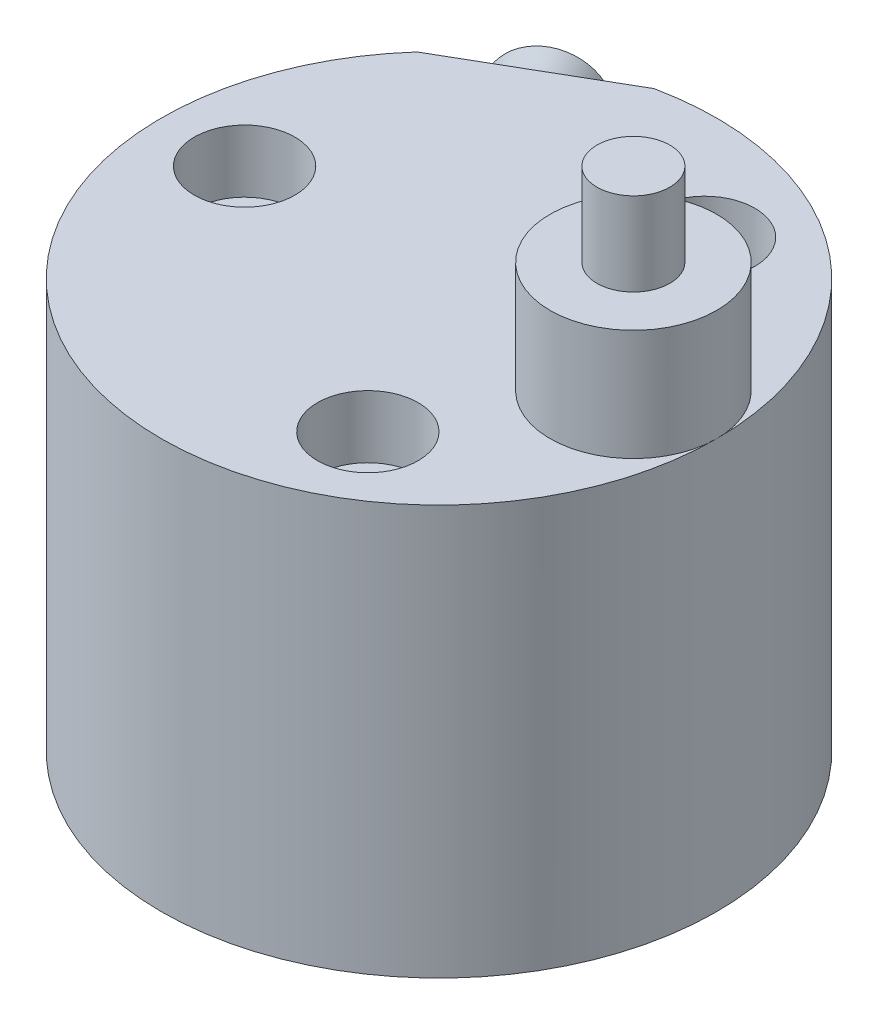
ISO-10303-21;
HEADER;
FILE_DESCRIPTION(('STEP AP214'),'2;1');
FILE_NAME('part.step','',(''),(''),'','','');
FILE_SCHEMA(('AUTOMOTIVE_DESIGN { 1 0 10303 214 1 1 1 1 }'));
ENDSEC;
DATA;
#1=APPLICATION_CONTEXT('core data for automotive mechanical design processes');
#2=APPLICATION_PROTOCOL_DEFINITION('international standard','automotive_design',2000,#1);
#3=PRODUCT_CONTEXT('',#1,'mechanical');
#4=PRODUCT('Part','Part','',(#3));
#5=PRODUCT_RELATED_PRODUCT_CATEGORY('part','',(#4));
#6=PRODUCT_DEFINITION_FORMATION('','',#4);
#7=PRODUCT_DEFINITION_CONTEXT('part definition',#1,'design');
#8=PRODUCT_DEFINITION('design','',#6,#7);
#9=PRODUCT_DEFINITION_SHAPE('','',#8);
#10=(LENGTH_UNIT() NAMED_UNIT(*) SI_UNIT(.MILLI.,.METRE.));
#11=(NAMED_UNIT(*) PLANE_ANGLE_UNIT() SI_UNIT($,.RADIAN.));
#12=(NAMED_UNIT(*) SI_UNIT($,.STERADIAN.) SOLID_ANGLE_UNIT());
#13=UNCERTAINTY_MEASURE_WITH_UNIT(LENGTH_MEASURE(1.E-05),#10,'distance_accuracy_value','');
#14=(GEOMETRIC_REPRESENTATION_CONTEXT(3) GLOBAL_UNCERTAINTY_ASSIGNED_CONTEXT((#13)) GLOBAL_UNIT_ASSIGNED_CONTEXT((#10,
#11,#12)) REPRESENTATION_CONTEXT('',''));
#15=CARTESIAN_POINT('',(0.,0.,0.));
#16=DIRECTION('',(0.,0.,1.));
#17=DIRECTION('',(1.,0.,0.));
#18=AXIS2_PLACEMENT_3D('',#15,#16,#17);
#19=CARTESIAN_POINT('',(-29.816653826392,43.5,-26.6639673454102));
#20=DIRECTION('',(0.5,0.,0.866025403784439));
#21=DIRECTION('',(0.866025403784439,0.,-0.5));
#22=AXIS2_PLACEMENT_3D('',#19,#20,#21);
#23=PLANE('',#22);
#24=DIRECTION('',(0.866025403784439,0.,-0.5));
#25=VECTOR('',#24,1.);
#26=CARTESIAN_POINT('',(-29.816653826392,59.,-26.6639673454102));
#27=LINE('',#26,#25);
#28=CARTESIAN_POINT('',(-29.816653826392,59.,-26.6639673454103));
#29=VERTEX_POINT('',#28);
#30=CARTESIAN_POINT('',(-8.18334617360865,59.,-39.1539633422067));
#31=VERTEX_POINT('',#30);
#32=EDGE_CURVE('E177',#29,#31,#27,.T.);
#33=ORIENTED_EDGE('',*,*,#32,.T.);
#34=DIRECTION('',(0.,1.,0.));
#35=VECTOR('',#34,1.);
#36=CARTESIAN_POINT('',(-8.18334617360865,43.5,-39.1539633422067));
#37=LINE('',#36,#35);
#38=CARTESIAN_POINT('',(-8.18334617360865,43.5,-39.1539633422067));
#39=VERTEX_POINT('',#38);
#40=EDGE_CURVE('E564',#39,#31,#37,.T.);
#41=ORIENTED_EDGE('',*,*,#40,.F.);
#42=DIRECTION('',(0.866025403784439,0.,-0.5));
#43=VECTOR('',#42,1.);
#44=CARTESIAN_POINT('',(-29.816653826392,43.5,-26.6639673454102));
#45=LINE('',#44,#43);
#46=CARTESIAN_POINT('',(-29.816653826392,43.5,-26.6639673454102));
#47=VERTEX_POINT('',#46);
#48=EDGE_CURVE('E571',#47,#39,#45,.T.);
#49=ORIENTED_EDGE('',*,*,#48,.F.);
#50=DIRECTION('',(0.,1.,0.));
#51=VECTOR('',#50,1.);
#52=CARTESIAN_POINT('',(-29.816653826392,43.5,-26.6639673454102));
#53=LINE('',#52,#51);
#54=EDGE_CURVE('E58',#47,#29,#53,.T.);
#55=ORIENTED_EDGE('',*,*,#54,.T.);
#56=EDGE_LOOP('',(#33,#41,#49,#55));
#57=FACE_BOUND('',#56,.T.);
#58=CARTESIAN_POINT('',(-18.9999999999996,51.5000000000003,-32.9089653438089));
#59=DIRECTION('',(0.5,0.,0.866025403784439));
#60=DIRECTION('',(0.866025403784439,0.,-0.5));
#61=AXIS2_PLACEMENT_3D('',#58,#59,#60);
#62=CIRCLE('',#61,7.);
#63=CARTESIAN_POINT('',(-12.9378221735086,51.5000000000003,-36.4089653438089));
#64=VERTEX_POINT('',#63);
#65=EDGE_CURVE('E12',#64,#64,#62,.F.);
#66=ORIENTED_EDGE('',*,*,#65,.F.);
#67=EDGE_LOOP('',(#66));
#68=FACE_BOUND('',#67,.T.);
#69=ADVANCED_FACE('F35',(#57,#68),#23,.F.);
#70=CARTESIAN_POINT('',(-25.7927989909334,51.5000000000004,-44.6744383217089));
#71=DIRECTION('',(-0.499999999999994,0.,-0.866025403784442));
#72=DIRECTION('',(-0.866025403784442,0.,0.499999999999995));
#73=AXIS2_PLACEMENT_3D('',#70,#71,#72);
#74=CYLINDRICAL_SURFACE('',#73,4.283);
#75=CARTESIAN_POINT('',(-13.9999999999998,47.3353764876044,-26.2487113059644));
#76=CARTESIAN_POINT('',(-13.8846803501762,47.3593623253568,-26.248703375027));
#77=CARTESIAN_POINT('',(-13.7697517761624,47.3858831845604,-26.2387089174552));
#78=CARTESIAN_POINT('',(-13.5435655926728,47.4411635474235,-26.1993313219503));
#79=CARTESIAN_POINT('',(-13.4323200942791,47.4699295587522,-26.1698898250953));
#80=CARTESIAN_POINT('',(-13.2163402167066,47.5264870806709,-26.0923543062892));
#81=CARTESIAN_POINT('',(-13.1116005101973,47.5542793802414,-26.0442757854433));
#82=CARTESIAN_POINT('',(-12.911210223568,47.6055822466804,-25.9303184689779));
#83=CARTESIAN_POINT('',(-12.8155509745316,47.6290969173732,-25.8644568862257));
#84=CARTESIAN_POINT('',(-12.6380956024121,47.6681932309555,-25.7177819363558));
#85=CARTESIAN_POINT('',(-12.5560447879495,47.6839351699755,-25.6373220342316));
#86=CARTESIAN_POINT('',(-12.4064914882523,47.7057478559666,-25.4627557956808));
#87=CARTESIAN_POINT('',(-12.338975367804,47.711827701574,-25.3686623889445));
#88=CARTESIAN_POINT('',(-12.227579503488,47.7132218204603,-25.1809802000658));
#89=CARTESIAN_POINT('',(-12.1819311265704,47.709631432406,-25.0884419293331));
#90=CARTESIAN_POINT('',(-12.1055562513608,47.6944806814061,-24.8980240100651));
#91=CARTESIAN_POINT('',(-12.0748317676831,47.6829192429374,-24.8001436423693));
#92=CARTESIAN_POINT('',(-12.0291471577467,47.6535549602009,-24.6033815888311));
#93=CARTESIAN_POINT('',(-12.0139485642091,47.635852304558,-24.5045393493094));
#94=CARTESIAN_POINT('',(-11.99837038372,47.5961198121907,-24.3065707392702));
#95=CARTESIAN_POINT('',(-11.997996060694,47.5740884411807,-24.2074442803246));
#96=CARTESIAN_POINT('',(-12.0124647762102,47.5254305660545,-24.0007068836194));
#97=CARTESIAN_POINT('',(-12.0288618778782,47.4985645863109,-23.8932603057773));
#98=CARTESIAN_POINT('',(-12.0787981517982,47.4448593754886,-23.6823762337472));
#99=CARTESIAN_POINT('',(-12.1123463111914,47.4180201658325,-23.5789408720352));
#100=CARTESIAN_POINT('',(-12.1988442446768,47.3652724139167,-23.3716348242785));
#101=CARTESIAN_POINT('',(-12.2529307727742,47.3395429202521,-23.2681880785014));
#102=CARTESIAN_POINT('',(-12.3790204887181,47.2939474011823,-23.0714005007499));
#103=CARTESIAN_POINT('',(-12.4510149863006,47.2740785419588,-22.9780547984439));
#104=CARTESIAN_POINT('',(-12.6067782178338,47.2434133551712,-22.8094857039865));
#105=CARTESIAN_POINT('',(-12.6896882850883,47.2321804897941,-22.7335506416689));
#106=CARTESIAN_POINT('',(-12.8675212329224,47.2183426526875,-22.5964164170215));
#107=CARTESIAN_POINT('',(-12.9624371086461,47.2157326737761,-22.5352087218822));
#108=CARTESIAN_POINT('',(-13.1529826481814,47.2192801777482,-22.4339794932127));
#109=CARTESIAN_POINT('',(-13.2479315195338,47.2247444996971,-22.3926433014052));
#110=CARTESIAN_POINT('',(-13.4424603393248,47.2426474611921,-22.3252387938854));
#111=CARTESIAN_POINT('',(-13.5420404745002,47.2550863821845,-22.2991710943898));
#112=CARTESIAN_POINT('',(-13.7436243576298,47.2858374414896,-22.2625526456059));
#113=CARTESIAN_POINT('',(-13.8456378758102,47.3041792091863,-22.2520817094441));
#114=CARTESIAN_POINT('',(-14.0492169158717,47.3450761487807,-22.2467230798684));
#115=CARTESIAN_POINT('',(-14.1507822797518,47.367632701379,-22.2518405013982));
#116=CARTESIAN_POINT('',(-14.3596886867012,47.4170019567712,-22.2782797113492));
#117=CARTESIAN_POINT('',(-14.4668193790618,47.4440120461325,-22.3008973027089));
#118=CARTESIAN_POINT('',(-14.6760150181686,47.4981069225508,-22.3632591362429));
#119=CARTESIAN_POINT('',(-14.7780766909674,47.5251917462581,-22.4030142907386));
#120=CARTESIAN_POINT('',(-14.9807409236475,47.5781317547646,-22.5018324697839));
#121=CARTESIAN_POINT('',(-15.080904711655,47.6038209585609,-22.5618934589876));
#122=CARTESIAN_POINT('',(-15.2701487088774,47.6486870004943,-22.6993975346607));
#123=CARTESIAN_POINT('',(-15.359237391621,47.6678688370692,-22.7768272036071));
#124=CARTESIAN_POINT('',(-15.5178705128638,47.695808953011,-22.9416913532032));
#125=CARTESIAN_POINT('',(-15.5882998715531,47.7051547893636,-23.0281708261566));
#126=CARTESIAN_POINT('',(-15.7139299271114,47.7140395730862,-23.2119794533333));
#127=CARTESIAN_POINT('',(-15.7691408827037,47.7135851432688,-23.3093012363108));
#128=CARTESIAN_POINT('',(-15.857891641831,47.7034899679475,-23.5014835911476));
#129=CARTESIAN_POINT('',(-15.8930124308677,47.6947431871621,-23.5956696472182));
#130=CARTESIAN_POINT('',(-15.9486341852211,47.6704767509161,-23.78741402187));
#131=CARTESIAN_POINT('',(-15.9691312466628,47.6549552887025,-23.8849732336494));
#132=CARTESIAN_POINT('',(-15.9958492360078,47.6183198159408,-24.0843011118719));
#133=CARTESIAN_POINT('',(-16.0015829868995,47.5970399863704,-24.1861033256664));
#134=CARTESIAN_POINT('',(-15.9976682465783,47.5513744625739,-24.3887116668475));
#135=CARTESIAN_POINT('',(-15.9880126448595,47.5269873374416,-24.4895173121227));
#136=CARTESIAN_POINT('',(-15.9518236669629,47.4746549568613,-24.6991425951561));
#137=CARTESIAN_POINT('',(-15.9235717190827,47.4466108531735,-24.8076441024381));
#138=CARTESIAN_POINT('',(-15.8491627628709,47.3923781417469,-25.0188663658474));
#139=CARTESIAN_POINT('',(-15.8030000722642,47.3661901259829,-25.1215852755617));
#140=CARTESIAN_POINT('',(-15.6919934922397,47.3177131732278,-25.3213524092135));
#141=CARTESIAN_POINT('',(-15.6266735385304,47.2955503544806,-25.4181689384037));
#142=CARTESIAN_POINT('',(-15.4793264212072,47.2585935866521,-25.599722735227));
#143=CARTESIAN_POINT('',(-15.3973129019774,47.2437936533702,-25.6844697722459));
#144=CARTESIAN_POINT('',(-15.2260714914618,47.2241719755316,-25.8325456327667));
#145=CARTESIAN_POINT('',(-15.1379308982124,47.2186522347307,-25.8970397754653));
#146=CARTESIAN_POINT('',(-14.9521940979289,47.2159896202719,-26.010863374224));
#147=CARTESIAN_POINT('',(-14.8545969644944,47.2188475681299,-26.0601913425654));
#148=CARTESIAN_POINT('',(-14.6592625682395,47.2322001301556,-26.1396992637684));
#149=CARTESIAN_POINT('',(-14.5618835100445,47.2422273023016,-26.1708487809341));
#150=CARTESIAN_POINT('',(-14.3644592291483,47.2684258879938,-26.2178318796635));
#151=CARTESIAN_POINT('',(-14.2644188620536,47.2845867414276,-26.2336916198143));
#152=CARTESIAN_POINT('',(-14.1095173878012,47.3131864656211,-26.2464707324859));
#153=CARTESIAN_POINT('',(-14.0547146757301,47.3239961431727,-26.2487150688848));
#154=CARTESIAN_POINT('',(-13.9999999999998,47.3353764876044,-26.2487113059644));
#155=B_SPLINE_CURVE_WITH_KNOTS('',3,(#75,#76,#77,#78,#79,#80,#81,#82,#83,#84,#85,#86,#87,#88,
#89,#90,#91,#92,#93,#94,#95,#96,#97,#98,#99,#100,#101,#102,#103,#104,#105,#106,#107,#108,#109,
#110,#111,#112,#113,#114,#115,#116,#117,#118,#119,#120,#121,#122,#123,#124,#125,#126,#127,#128,
#129,#130,#131,#132,#133,#134,#135,#136,#137,#138,#139,#140,#141,#142,#143,#144,#145,#146,#147,
#148,#149,#150,#151,#152,#153,#154),.UNSPECIFIED.,.T.,.F.,(4,2,2,2,2,2,2,2,2,2,2,2,2,2,2,2,2,2,
2,2,2,2,2,2,2,2,2,2,2,2,2,2,2,2,2,2,2,2,2,4),(0.,0.353194917384889,0.707454587754101,
1.06142023724004,1.41504449127221,1.7610348713176,2.10669924437398,2.41490120166485,
2.7231447523695,3.0265792786907,3.3301215501043,3.66458539417977,3.99922467696384,
4.3560034342581,4.71260939288266,5.04972349031286,5.38664179616279,5.69626484991283,
6.00590039878884,6.31711506266764,6.62843185513088,6.96530609342621,7.30239515354667,
7.65930765260401,8.01594537605461,8.34980221802498,8.68343345367751,8.98475223335371,
9.28615142147176,9.59737606098506,9.90874454061353,10.2539175925522,10.5992002420716,
10.9539191966311,11.3083493796988,11.6346827651621,11.9610481519381,12.2678744220598,
12.5741748205119,12.7417520322346),.UNSPECIFIED.);
#156=CARTESIAN_POINT('',(-13.9999999999998,47.3353764876044,-26.2487113059644));
#157=VERTEX_POINT('',#156);
#158=EDGE_CURVE('E170',#157,#157,#155,.T.);
#159=ORIENTED_EDGE('',*,*,#158,.T.);
#160=EDGE_LOOP('',(#159));
#161=FACE_BOUND('',#160,.T.);
#162=CARTESIAN_POINT('',(-11.4999999999997,51.5000000000002,-19.9185842870423));
#163=DIRECTION('',(-0.499999999999994,0.,-0.866025403784442));
#164=DIRECTION('',(-0.866025403784442,0.,0.499999999999995));
#165=AXIS2_PLACEMENT_3D('',#162,#163,#164);
#166=CIRCLE('',#165,4.28300000000001);
#167=CARTESIAN_POINT('',(-15.2091868044085,51.5000000000002,-17.7770842870423));
#168=VERTEX_POINT('',#167);
#169=EDGE_CURVE('E167',#168,#168,#166,.T.);
#170=ORIENTED_EDGE('',*,*,#169,.F.);
#171=EDGE_LOOP('',(#170));
#172=FACE_BOUND('',#171,.T.);
#173=CARTESIAN_POINT('',(-15.7094999999997,51.5000000000003,-27.2096521615035));
#174=DIRECTION('',(-0.499999999999994,0.,-0.866025403784442));
#175=DIRECTION('',(-0.866025403784442,0.,0.499999999999995));
#176=AXIS2_PLACEMENT_3D('',#173,#174,#175);
#177=CIRCLE('',#176,4.283);
#178=CARTESIAN_POINT('',(-19.4186868044085,51.5000000000003,-25.0681521615035));
#179=VERTEX_POINT('',#178);
#180=EDGE_CURVE('E164',#179,#179,#177,.T.);
#181=ORIENTED_EDGE('',*,*,#180,.T.);
#182=EDGE_LOOP('',(#181));
#183=FACE_BOUND('',#182,.T.);
#184=ADVANCED_FACE('F184',(#161,#172,#183),#74,.F.);
#185=CARTESIAN_POINT('',(-13.9999999999998,51.5,-24.2487113059644));
#186=DIRECTION('',(0.,-1.,0.));
#187=DIRECTION('',(0.,0.,-1.));
#188=AXIS2_PLACEMENT_3D('',#185,#186,#187);
#189=CYLINDRICAL_SURFACE('',#188,2.);
#190=CARTESIAN_POINT('',(-13.9999999999998,3.,-24.2487113059644));
#191=DIRECTION('',(0.,-1.,0.));
#192=DIRECTION('',(0.,0.,-1.));
#193=AXIS2_PLACEMENT_3D('',#190,#191,#192);
#194=CIRCLE('',#193,2.);
#195=CARTESIAN_POINT('',(-13.9999999999998,3.,-26.2487113059644));
#196=VERTEX_POINT('',#195);
#197=EDGE_CURVE('E566',#196,#196,#194,.T.);
#198=ORIENTED_EDGE('',*,*,#197,.T.);
#199=EDGE_LOOP('',(#198));
#200=FACE_BOUND('',#199,.T.);
#201=ORIENTED_EDGE('',*,*,#158,.F.);
#202=EDGE_LOOP('',(#201));
#203=FACE_BOUND('',#202,.T.);
#204=ADVANCED_FACE('F180',(#200,#203),#189,.F.);
#205=CARTESIAN_POINT('',(0.,75.,0.));
#206=DIRECTION('',(0.,1.,0.));
#207=DIRECTION('',(0.,0.,1.));
#208=AXIS2_PLACEMENT_3D('',#205,#206,#207);
#209=PLANE('',#208);
#210=CARTESIAN_POINT('',(28.,75.,0.));
#211=DIRECTION('',(0.,1.,0.));
#212=DIRECTION('',(0.,0.,1.));
#213=AXIS2_PLACEMENT_3D('',#210,#211,#212);
#214=CIRCLE('',#213,12.);
#215=CARTESIAN_POINT('',(28.,75.,12.));
#216=VERTEX_POINT('',#215);
#217=EDGE_CURVE('E549',#216,#216,#214,.T.);
#218=ORIENTED_EDGE('',*,*,#217,.T.);
#219=EDGE_LOOP('',(#218));
#220=FACE_BOUND('',#219,.T.);
#221=CARTESIAN_POINT('',(28.,75.,0.));
#222=DIRECTION('',(0.,1.,0.));
#223=DIRECTION('',(0.,0.,1.));
#224=AXIS2_PLACEMENT_3D('',#221,#222,#223);
#225=CIRCLE('',#224,5.25);
#226=CARTESIAN_POINT('',(28.,75.,5.25));
#227=VERTEX_POINT('',#226);
#228=EDGE_CURVE('E628',#227,#227,#225,.T.);
#229=ORIENTED_EDGE('',*,*,#228,.F.);
#230=EDGE_LOOP('',(#229));
#231=FACE_BOUND('',#230,.T.);
#232=ADVANCED_FACE('F319',(#220,#231),#209,.T.);
#233=CARTESIAN_POINT('',(0.,59.,0.));
#234=DIRECTION('',(0.,-1.,0.));
#235=DIRECTION('',(0.,0.,-1.));
#236=AXIS2_PLACEMENT_3D('',#233,#234,#235);
#237=CYLINDRICAL_SURFACE('',#236,40.);
#238=CARTESIAN_POINT('',(0.,59.,0.));
#239=DIRECTION('',(0.,1.,0.));
#240=DIRECTION('',(0.,0.,1.));
#241=AXIS2_PLACEMENT_3D('',#238,#239,#240);
#242=CIRCLE('',#241,40.);
#243=CARTESIAN_POINT('',(40.,59.,0.));
#244=VERTEX_POINT('',#243);
#245=EDGE_CURVE('E553',#29,#244,#242,.T.);
#246=ORIENTED_EDGE('',*,*,#245,.F.);
#247=ORIENTED_EDGE('',*,*,#54,.F.);
#248=CARTESIAN_POINT('',(0.,43.5,0.));
#249=DIRECTION('',(0.,1.,0.));
#250=DIRECTION('',(0.,0.,1.));
#251=AXIS2_PLACEMENT_3D('',#248,#249,#250);
#252=CIRCLE('',#251,39.9999999999999);
#253=EDGE_CURVE('E178',#39,#47,#252,.T.);
#254=ORIENTED_EDGE('',*,*,#253,.F.);
#255=ORIENTED_EDGE('',*,*,#40,.T.);
#256=EDGE_CURVE('E43',#244,#31,#242,.T.);
#257=ORIENTED_EDGE('',*,*,#256,.F.);
#258=EDGE_LOOP('',(#246,#247,#254,#255,#257));
#259=FACE_BOUND('',#258,.T.);
#260=CARTESIAN_POINT('',(0.,0.,0.));
#261=DIRECTION('',(0.,1.,0.));
#262=DIRECTION('',(0.,0.,1.));
#263=AXIS2_PLACEMENT_3D('',#260,#261,#262);
#264=CIRCLE('',#263,40.);
#265=CARTESIAN_POINT('',(0.,0.,40.));
#266=VERTEX_POINT('',#265);
#267=EDGE_CURVE('E550',#266,#266,#264,.T.);
#268=ORIENTED_EDGE('',*,*,#267,.T.);
#269=EDGE_LOOP('',(#268));
#270=FACE_BOUND('',#269,.T.);
#271=ADVANCED_FACE('F37',(#259,#270),#237,.T.);
#272=CARTESIAN_POINT('',(0.,59.,0.));
#273=DIRECTION('',(0.,1.,0.));
#274=DIRECTION('',(0.,0.,1.));
#275=AXIS2_PLACEMENT_3D('',#272,#273,#274);
#276=PLANE('',#275);
#277=ORIENTED_EDGE('',*,*,#32,.F.);
#278=ORIENTED_EDGE('',*,*,#245,.T.);
#279=CARTESIAN_POINT('',(28.,59.,0.));
#280=DIRECTION('',(0.,1.,0.));
#281=DIRECTION('',(0.,0.,1.));
#282=AXIS2_PLACEMENT_3D('',#279,#280,#281);
#283=CIRCLE('',#282,12.);
#284=EDGE_CURVE('E546',#244,#244,#283,.T.);
#285=ORIENTED_EDGE('',*,*,#284,.F.);
#286=ORIENTED_EDGE('',*,*,#256,.T.);
#287=EDGE_LOOP('',(#277,#278,#285,#286));
#288=FACE_BOUND('',#287,.T.);
#289=CARTESIAN_POINT('',(13.9999999999998,59.,24.2487113059644));
#290=DIRECTION('',(0.,1.,0.));
#291=DIRECTION('',(0.,0.,1.));
#292=AXIS2_PLACEMENT_3D('',#289,#290,#291);
#293=CIRCLE('',#292,7.25000000000002);
#294=CARTESIAN_POINT('',(13.9999999999998,59.,31.4987113059644));
#295=VERTEX_POINT('',#294);
#296=EDGE_CURVE('E590',#295,#295,#293,.T.);
#297=ORIENTED_EDGE('',*,*,#296,.F.);
#298=EDGE_LOOP('',(#297));
#299=FACE_BOUND('',#298,.T.);
#300=CARTESIAN_POINT('',(14.0000000000001,59.,-24.2487113059642));
#301=DIRECTION('',(0.,1.,0.));
#302=DIRECTION('',(0.,0.,1.));
#303=AXIS2_PLACEMENT_3D('',#300,#301,#302);
#304=CIRCLE('',#303,7.25000000000002);
#305=CARTESIAN_POINT('',(14.0000000000001,59.,-16.9987113059642));
#306=VERTEX_POINT('',#305);
#307=EDGE_CURVE('E604',#306,#306,#304,.T.);
#308=ORIENTED_EDGE('',*,*,#307,.F.);
#309=EDGE_LOOP('',(#308));
#310=FACE_BOUND('',#309,.T.);
#311=CARTESIAN_POINT('',(-28.,59.,0.));
#312=DIRECTION('',(0.,1.,0.));
#313=DIRECTION('',(0.,0.,1.));
#314=AXIS2_PLACEMENT_3D('',#311,#312,#313);
#315=CIRCLE('',#314,7.25000000000002);
#316=CARTESIAN_POINT('',(-28.,59.,7.25000000000002));
#317=VERTEX_POINT('',#316);
#318=EDGE_CURVE('E616',#317,#317,#315,.T.);
#319=ORIENTED_EDGE('',*,*,#318,.F.);
#320=EDGE_LOOP('',(#319));
#321=FACE_BOUND('',#320,.T.);
#322=ADVANCED_FACE('F333',(#288,#299,#310,#321),#276,.T.);
#323=CARTESIAN_POINT('',(0.,0.,0.));
#324=DIRECTION('',(0.,1.,0.));
#325=DIRECTION('',(0.,0.,1.));
#326=AXIS2_PLACEMENT_3D('',#323,#324,#325);
#327=PLANE('',#326);
#328=CARTESIAN_POINT('',(-13.9999999999998,0.,-24.2487113059644));
#329=DIRECTION('',(0.,-1.,0.));
#330=DIRECTION('',(0.,0.,-1.));
#331=AXIS2_PLACEMENT_3D('',#328,#329,#330);
#332=CIRCLE('',#331,5.);
#333=CARTESIAN_POINT('',(-13.9999999999998,0.,-29.2487113059644));
#334=VERTEX_POINT('',#333);
#335=EDGE_CURVE('E569',#334,#334,#332,.T.);
#336=ORIENTED_EDGE('',*,*,#335,.F.);
#337=EDGE_LOOP('',(#336));
#338=FACE_BOUND('',#337,.T.);
#339=CARTESIAN_POINT('',(-14.,0.,24.2487113059643));
#340=DIRECTION('',(0.,-1.,0.));
#341=DIRECTION('',(0.,0.,-1.));
#342=AXIS2_PLACEMENT_3D('',#339,#340,#341);
#343=CIRCLE('',#342,4.);
#344=CARTESIAN_POINT('',(-14.,0.,20.2487113059643));
#345=VERTEX_POINT('',#344);
#346=EDGE_CURVE('E578',#345,#345,#343,.T.);
#347=ORIENTED_EDGE('',*,*,#346,.F.);
#348=EDGE_LOOP('',(#347));
#349=FACE_BOUND('',#348,.T.);
#350=CARTESIAN_POINT('',(0.,0.,0.));
#351=DIRECTION('',(0.,-1.,0.));
#352=DIRECTION('',(0.,0.,-1.));
#353=AXIS2_PLACEMENT_3D('',#350,#351,#352);
#354=CIRCLE('',#353,4.);
#355=CARTESIAN_POINT('',(0.,0.,-4.));
#356=VERTEX_POINT('',#355);
#357=EDGE_CURVE('E584',#356,#356,#354,.T.);
#358=ORIENTED_EDGE('',*,*,#357,.F.);
#359=EDGE_LOOP('',(#358));
#360=FACE_BOUND('',#359,.T.);
#361=CARTESIAN_POINT('',(13.9999999999998,0.,24.2487113059644));
#362=DIRECTION('',(0.,1.,0.));
#363=DIRECTION('',(0.,0.,1.));
#364=AXIS2_PLACEMENT_3D('',#361,#362,#363);
#365=CIRCLE('',#364,4.50000000000001);
#366=CARTESIAN_POINT('',(13.9999999999998,0.,28.7487113059644));
#367=VERTEX_POINT('',#366);
#368=EDGE_CURVE('E601',#367,#367,#365,.T.);
#369=ORIENTED_EDGE('',*,*,#368,.T.);
#370=EDGE_LOOP('',(#369));
#371=FACE_BOUND('',#370,.T.);
#372=CARTESIAN_POINT('',(14.0000000000001,0.,-24.2487113059642));
#373=DIRECTION('',(0.,1.,0.));
#374=DIRECTION('',(0.,0.,1.));
#375=AXIS2_PLACEMENT_3D('',#372,#373,#374);
#376=CIRCLE('',#375,4.50000000000001);
#377=CARTESIAN_POINT('',(14.0000000000001,0.,-19.7487113059642));
#378=VERTEX_POINT('',#377);
#379=EDGE_CURVE('E613',#378,#378,#376,.T.);
#380=ORIENTED_EDGE('',*,*,#379,.T.);
#381=EDGE_LOOP('',(#380));
#382=FACE_BOUND('',#381,.T.);
#383=CARTESIAN_POINT('',(-28.,0.,0.));
#384=DIRECTION('',(0.,1.,0.));
#385=DIRECTION('',(0.,0.,1.));
#386=AXIS2_PLACEMENT_3D('',#383,#384,#385);
#387=CIRCLE('',#386,4.50000000000001);
#388=CARTESIAN_POINT('',(-28.,0.,4.50000000000001));
#389=VERTEX_POINT('',#388);
#390=EDGE_CURVE('E625',#389,#389,#387,.T.);
#391=ORIENTED_EDGE('',*,*,#390,.T.);
#392=EDGE_LOOP('',(#391));
#393=FACE_BOUND('',#392,.T.);
#394=ORIENTED_EDGE('',*,*,#267,.F.);
#395=EDGE_LOOP('',(#394));
#396=FACE_BOUND('',#395,.T.);
#397=ADVANCED_FACE('F338',(#338,#349,#360,#371,#382,#393,#396),#327,.F.);
#398=CARTESIAN_POINT('',(28.,183.941125496954,0.));
#399=DIRECTION('',(0.,-1.,0.));
#400=DIRECTION('',(0.,0.,-1.));
#401=AXIS2_PLACEMENT_3D('',#398,#399,#400);
#402=CYLINDRICAL_SURFACE('',#401,12.);
#403=ORIENTED_EDGE('',*,*,#284,.T.);
#404=EDGE_LOOP('',(#403));
#405=FACE_BOUND('',#404,.T.);
#406=ORIENTED_EDGE('',*,*,#217,.F.);
#407=EDGE_LOOP('',(#406));
#408=FACE_BOUND('',#407,.T.);
#409=ADVANCED_FACE('F375',(#405,#408),#402,.T.);
#410=CARTESIAN_POINT('',(28.,87.,0.));
#411=DIRECTION('',(0.,-1.,0.));
#412=DIRECTION('',(0.,0.,-1.));
#413=AXIS2_PLACEMENT_3D('',#410,#411,#412);
#414=CYLINDRICAL_SURFACE('',#413,5.25);
#415=CARTESIAN_POINT('',(28.,87.,0.));
#416=DIRECTION('',(0.,1.,0.));
#417=DIRECTION('',(0.,0.,1.));
#418=AXIS2_PLACEMENT_3D('',#415,#416,#417);
#419=CIRCLE('',#418,5.25);
#420=CARTESIAN_POINT('',(28.,87.,5.25));
#421=VERTEX_POINT('',#420);
#422=EDGE_CURVE('E554',#421,#421,#419,.T.);
#423=ORIENTED_EDGE('',*,*,#422,.F.);
#424=EDGE_LOOP('',(#423));
#425=FACE_BOUND('',#424,.T.);
#426=ORIENTED_EDGE('',*,*,#228,.T.);
#427=EDGE_LOOP('',(#426));
#428=FACE_BOUND('',#427,.T.);
#429=ADVANCED_FACE('F514',(#425,#428),#414,.T.);
#430=CARTESIAN_POINT('',(28.,87.,0.));
#431=DIRECTION('',(0.,1.,0.));
#432=DIRECTION('',(0.,0.,1.));
#433=AXIS2_PLACEMENT_3D('',#430,#431,#432);
#434=PLANE('',#433);
#435=ORIENTED_EDGE('',*,*,#422,.T.);
#436=EDGE_LOOP('',(#435));
#437=FACE_BOUND('',#436,.T.);
#438=ADVANCED_FACE('F504',(#437),#434,.T.);
#439=CARTESIAN_POINT('',(-28.,59.,0.));
#440=DIRECTION('',(0.,1.,0.));
#441=DIRECTION('',(0.,0.,1.));
#442=AXIS2_PLACEMENT_3D('',#439,#440,#441);
#443=CYLINDRICAL_SURFACE('',#442,4.50000000000001);
#444=ORIENTED_EDGE('',*,*,#390,.F.);
#445=EDGE_LOOP('',(#444));
#446=FACE_BOUND('',#445,.T.);
#447=CARTESIAN_POINT('',(-28.,50.,0.));
#448=DIRECTION('',(0.,1.,0.));
#449=DIRECTION('',(0.,0.,1.));
#450=AXIS2_PLACEMENT_3D('',#447,#448,#449);
#451=CIRCLE('',#450,4.50000000000001);
#452=CARTESIAN_POINT('',(-28.,50.,4.50000000000001));
#453=VERTEX_POINT('',#452);
#454=EDGE_CURVE('E622',#453,#453,#451,.T.);
#455=ORIENTED_EDGE('',*,*,#454,.T.);
#456=EDGE_LOOP('',(#455));
#457=FACE_BOUND('',#456,.T.);
#458=ADVANCED_FACE('F494',(#446,#457),#443,.F.);
#459=CARTESIAN_POINT('',(-23.5,50.,0.));
#460=DIRECTION('',(0.,-1.,0.));
#461=DIRECTION('',(0.,0.,-1.));
#462=AXIS2_PLACEMENT_3D('',#459,#460,#461);
#463=PLANE('',#462);
#464=ORIENTED_EDGE('',*,*,#454,.F.);
#465=EDGE_LOOP('',(#464));
#466=FACE_BOUND('',#465,.T.);
#467=CARTESIAN_POINT('',(-28.,50.,0.));
#468=DIRECTION('',(0.,1.,0.));
#469=DIRECTION('',(0.,0.,1.));
#470=AXIS2_PLACEMENT_3D('',#467,#468,#469);
#471=CIRCLE('',#470,7.25000000000001);
#472=CARTESIAN_POINT('',(-28.,50.,7.25000000000001));
#473=VERTEX_POINT('',#472);
#474=EDGE_CURVE('E619',#473,#473,#471,.T.);
#475=ORIENTED_EDGE('',*,*,#474,.T.);
#476=EDGE_LOOP('',(#475));
#477=FACE_BOUND('',#476,.T.);
#478=ADVANCED_FACE('F484',(#466,#477),#463,.F.);
#479=CARTESIAN_POINT('',(-28.,59.,0.));
#480=DIRECTION('',(0.,1.,0.));
#481=DIRECTION('',(0.,0.,1.));
#482=AXIS2_PLACEMENT_3D('',#479,#480,#481);
#483=CYLINDRICAL_SURFACE('',#482,7.25000000000002);
#484=ORIENTED_EDGE('',*,*,#474,.F.);
#485=EDGE_LOOP('',(#484));
#486=FACE_BOUND('',#485,.T.);
#487=ORIENTED_EDGE('',*,*,#318,.T.);
#488=EDGE_LOOP('',(#487));
#489=FACE_BOUND('',#488,.T.);
#490=ADVANCED_FACE('F474',(#486,#489),#483,.F.);
#491=CARTESIAN_POINT('',(14.0000000000001,59.,-24.2487113059642));
#492=DIRECTION('',(0.,1.,0.));
#493=DIRECTION('',(0.,0.,1.));
#494=AXIS2_PLACEMENT_3D('',#491,#492,#493);
#495=CYLINDRICAL_SURFACE('',#494,4.50000000000001);
#496=ORIENTED_EDGE('',*,*,#379,.F.);
#497=EDGE_LOOP('',(#496));
#498=FACE_BOUND('',#497,.T.);
#499=CARTESIAN_POINT('',(14.0000000000001,50.,-24.2487113059642));
#500=DIRECTION('',(0.,1.,0.));
#501=DIRECTION('',(0.,0.,1.));
#502=AXIS2_PLACEMENT_3D('',#499,#500,#501);
#503=CIRCLE('',#502,4.50000000000001);
#504=CARTESIAN_POINT('',(14.0000000000001,50.,-19.7487113059642));
#505=VERTEX_POINT('',#504);
#506=EDGE_CURVE('E610',#505,#505,#503,.T.);
#507=ORIENTED_EDGE('',*,*,#506,.T.);
#508=EDGE_LOOP('',(#507));
#509=FACE_BOUND('',#508,.T.);
#510=ADVANCED_FACE('F464',(#498,#509),#495,.F.);
#511=CARTESIAN_POINT('',(18.5000000000001,50.,-24.2487113059642));
#512=DIRECTION('',(0.,-1.,0.));
#513=DIRECTION('',(0.,0.,-1.));
#514=AXIS2_PLACEMENT_3D('',#511,#512,#513);
#515=PLANE('',#514);
#516=ORIENTED_EDGE('',*,*,#506,.F.);
#517=EDGE_LOOP('',(#516));
#518=FACE_BOUND('',#517,.T.);
#519=CARTESIAN_POINT('',(14.0000000000001,50.,-24.2487113059642));
#520=DIRECTION('',(0.,1.,0.));
#521=DIRECTION('',(0.,0.,1.));
#522=AXIS2_PLACEMENT_3D('',#519,#520,#521);
#523=CIRCLE('',#522,7.25000000000002);
#524=CARTESIAN_POINT('',(14.0000000000001,50.,-16.9987113059642));
#525=VERTEX_POINT('',#524);
#526=EDGE_CURVE('E607',#525,#525,#523,.T.);
#527=ORIENTED_EDGE('',*,*,#526,.T.);
#528=EDGE_LOOP('',(#527));
#529=FACE_BOUND('',#528,.T.);
#530=ADVANCED_FACE('F454',(#518,#529),#515,.F.);
#531=CARTESIAN_POINT('',(14.0000000000001,59.,-24.2487113059642));
#532=DIRECTION('',(0.,1.,0.));
#533=DIRECTION('',(0.,0.,1.));
#534=AXIS2_PLACEMENT_3D('',#531,#532,#533);
#535=CYLINDRICAL_SURFACE('',#534,7.25000000000002);
#536=ORIENTED_EDGE('',*,*,#526,.F.);
#537=EDGE_LOOP('',(#536));
#538=FACE_BOUND('',#537,.T.);
#539=ORIENTED_EDGE('',*,*,#307,.T.);
#540=EDGE_LOOP('',(#539));
#541=FACE_BOUND('',#540,.T.);
#542=ADVANCED_FACE('F444',(#538,#541),#535,.F.);
#543=CARTESIAN_POINT('',(13.9999999999998,59.,24.2487113059644));
#544=DIRECTION('',(0.,1.,0.));
#545=DIRECTION('',(0.,0.,1.));
#546=AXIS2_PLACEMENT_3D('',#543,#544,#545);
#547=CYLINDRICAL_SURFACE('',#546,4.50000000000001);
#548=ORIENTED_EDGE('',*,*,#368,.F.);
#549=EDGE_LOOP('',(#548));
#550=FACE_BOUND('',#549,.T.);
#551=CARTESIAN_POINT('',(13.9999999999998,50.,24.2487113059644));
#552=DIRECTION('',(0.,1.,0.));
#553=DIRECTION('',(0.,0.,1.));
#554=AXIS2_PLACEMENT_3D('',#551,#552,#553);
#555=CIRCLE('',#554,4.50000000000001);
#556=CARTESIAN_POINT('',(13.9999999999998,50.,28.7487113059644));
#557=VERTEX_POINT('',#556);
#558=EDGE_CURVE('E598',#557,#557,#555,.T.);
#559=ORIENTED_EDGE('',*,*,#558,.T.);
#560=EDGE_LOOP('',(#559));
#561=FACE_BOUND('',#560,.T.);
#562=ADVANCED_FACE('F434',(#550,#561),#547,.F.);
#563=CARTESIAN_POINT('',(18.4999999999998,50.,24.2487113059644));
#564=DIRECTION('',(0.,-1.,0.));
#565=DIRECTION('',(0.,0.,-1.));
#566=AXIS2_PLACEMENT_3D('',#563,#564,#565);
#567=PLANE('',#566);
#568=ORIENTED_EDGE('',*,*,#558,.F.);
#569=EDGE_LOOP('',(#568));
#570=FACE_BOUND('',#569,.T.);
#571=CARTESIAN_POINT('',(13.9999999999998,50.,24.2487113059644));
#572=DIRECTION('',(0.,1.,0.));
#573=DIRECTION('',(0.,0.,1.));
#574=AXIS2_PLACEMENT_3D('',#571,#572,#573);
#575=CIRCLE('',#574,7.25000000000002);
#576=CARTESIAN_POINT('',(13.9999999999998,50.,31.4987113059644));
#577=VERTEX_POINT('',#576);
#578=EDGE_CURVE('E595',#577,#577,#575,.T.);
#579=ORIENTED_EDGE('',*,*,#578,.T.);
#580=EDGE_LOOP('',(#579));
#581=FACE_BOUND('',#580,.T.);
#582=ADVANCED_FACE('F424',(#570,#581),#567,.F.);
#583=CARTESIAN_POINT('',(13.9999999999998,59.,24.2487113059644));
#584=DIRECTION('',(0.,1.,0.));
#585=DIRECTION('',(0.,0.,1.));
#586=AXIS2_PLACEMENT_3D('',#583,#584,#585);
#587=CYLINDRICAL_SURFACE('',#586,7.25000000000002);
#588=ORIENTED_EDGE('',*,*,#578,.F.);
#589=EDGE_LOOP('',(#588));
#590=FACE_BOUND('',#589,.T.);
#591=ORIENTED_EDGE('',*,*,#296,.T.);
#592=EDGE_LOOP('',(#591));
#593=FACE_BOUND('',#592,.T.);
#594=ADVANCED_FACE('F414',(#590,#593),#587,.F.);
#595=CARTESIAN_POINT('',(0.,4.,0.));
#596=DIRECTION('',(0.,-1.,0.));
#597=DIRECTION('',(0.,0.,-1.));
#598=AXIS2_PLACEMENT_3D('',#595,#596,#597);
#599=CYLINDRICAL_SURFACE('',#598,4.);
#600=CARTESIAN_POINT('',(0.,4.,0.));
#601=DIRECTION('',(0.,-1.,0.));
#602=DIRECTION('',(0.,0.,-1.));
#603=AXIS2_PLACEMENT_3D('',#600,#601,#602);
#604=CIRCLE('',#603,4.);
#605=CARTESIAN_POINT('',(0.,4.,-4.));
#606=VERTEX_POINT('',#605);
#607=EDGE_CURVE('E587',#606,#606,#604,.T.);
#608=ORIENTED_EDGE('',*,*,#607,.F.);
#609=EDGE_LOOP('',(#608));
#610=FACE_BOUND('',#609,.T.);
#611=ORIENTED_EDGE('',*,*,#357,.T.);
#612=EDGE_LOOP('',(#611));
#613=FACE_BOUND('',#612,.T.);
#614=ADVANCED_FACE('F404',(#610,#613),#599,.F.);
#615=CARTESIAN_POINT('',(0.,4.,0.));
#616=DIRECTION('',(0.,-1.,0.));
#617=DIRECTION('',(0.,0.,-1.));
#618=AXIS2_PLACEMENT_3D('',#615,#616,#617);
#619=PLANE('',#618);
#620=ORIENTED_EDGE('',*,*,#607,.T.);
#621=EDGE_LOOP('',(#620));
#622=FACE_BOUND('',#621,.T.);
#623=ADVANCED_FACE('F394',(#622),#619,.T.);
#624=CARTESIAN_POINT('',(-14.,10.,24.2487113059643));
#625=DIRECTION('',(0.,-1.,0.));
#626=DIRECTION('',(0.,0.,-1.));
#627=AXIS2_PLACEMENT_3D('',#624,#625,#626);
#628=CYLINDRICAL_SURFACE('',#627,4.);
#629=CARTESIAN_POINT('',(-14.,10.,24.2487113059643));
#630=DIRECTION('',(0.,-1.,0.));
#631=DIRECTION('',(0.,0.,-1.));
#632=AXIS2_PLACEMENT_3D('',#629,#630,#631);
#633=CIRCLE('',#632,4.);
#634=CARTESIAN_POINT('',(-14.,10.,20.2487113059643));
#635=VERTEX_POINT('',#634);
#636=EDGE_CURVE('E581',#635,#635,#633,.T.);
#637=ORIENTED_EDGE('',*,*,#636,.F.);
#638=EDGE_LOOP('',(#637));
#639=FACE_BOUND('',#638,.T.);
#640=ORIENTED_EDGE('',*,*,#346,.T.);
#641=EDGE_LOOP('',(#640));
#642=FACE_BOUND('',#641,.T.);
#643=ADVANCED_FACE('F384',(#639,#642),#628,.F.);
#644=CARTESIAN_POINT('',(-14.,10.,24.2487113059643));
#645=DIRECTION('',(0.,-1.,0.));
#646=DIRECTION('',(0.,0.,-1.));
#647=AXIS2_PLACEMENT_3D('',#644,#645,#646);
#648=PLANE('',#647);
#649=ORIENTED_EDGE('',*,*,#636,.T.);
#650=EDGE_LOOP('',(#649));
#651=FACE_BOUND('',#650,.T.);
#652=ADVANCED_FACE('F365',(#651),#648,.T.);
#653=CARTESIAN_POINT('',(-13.9999999999998,3.,-24.2487113059644));
#654=DIRECTION('',(0.,-1.,0.));
#655=DIRECTION('',(0.,0.,-1.));
#656=AXIS2_PLACEMENT_3D('',#653,#654,#655);
#657=CYLINDRICAL_SURFACE('',#656,5.);
#658=CARTESIAN_POINT('',(-13.9999999999998,3.,-24.2487113059644));
#659=DIRECTION('',(0.,-1.,0.));
#660=DIRECTION('',(0.,0.,-1.));
#661=AXIS2_PLACEMENT_3D('',#658,#659,#660);
#662=CIRCLE('',#661,5.);
#663=CARTESIAN_POINT('',(-13.9999999999998,3.,-29.2487113059644));
#664=VERTEX_POINT('',#663);
#665=EDGE_CURVE('E575',#664,#664,#662,.T.);
#666=ORIENTED_EDGE('',*,*,#665,.F.);
#667=EDGE_LOOP('',(#666));
#668=FACE_BOUND('',#667,.T.);
#669=ORIENTED_EDGE('',*,*,#335,.T.);
#670=EDGE_LOOP('',(#669));
#671=FACE_BOUND('',#670,.T.);
#672=ADVANCED_FACE('F356',(#668,#671),#657,.F.);
#673=CARTESIAN_POINT('',(-13.9999999999998,3.,-24.2487113059644));
#674=DIRECTION('',(0.,-1.,0.));
#675=DIRECTION('',(0.,0.,-1.));
#676=AXIS2_PLACEMENT_3D('',#673,#674,#675);
#677=PLANE('',#676);
#678=ORIENTED_EDGE('',*,*,#197,.F.);
#679=EDGE_LOOP('',(#678));
#680=FACE_BOUND('',#679,.T.);
#681=ORIENTED_EDGE('',*,*,#665,.T.);
#682=EDGE_LOOP('',(#681));
#683=FACE_BOUND('',#682,.T.);
#684=ADVANCED_FACE('F199',(#680,#683),#677,.T.);
#685=CARTESIAN_POINT('',(0.,43.5,0.));
#686=DIRECTION('',(0.,1.,0.));
#687=DIRECTION('',(0.,0.,1.));
#688=AXIS2_PLACEMENT_3D('',#685,#686,#687);
#689=PLANE('',#688);
#690=ORIENTED_EDGE('',*,*,#253,.T.);
#691=ORIENTED_EDGE('',*,*,#48,.T.);
#692=EDGE_LOOP('',(#690,#691));
#693=FACE_BOUND('',#692,.T.);
#694=ADVANCED_FACE('F196',(#693),#689,.T.);
#695=CARTESIAN_POINT('',(-11.4999999999998,47.2170000000002,-19.9185842870423));
#696=DIRECTION('',(-0.499999999999994,0.,-0.866025403784442));
#697=DIRECTION('',(-0.866025403784442,0.,0.499999999999995));
#698=AXIS2_PLACEMENT_3D('',#695,#696,#697);
#699=PLANE('',#698);
#700=ORIENTED_EDGE('',*,*,#169,.T.);
#701=EDGE_LOOP('',(#700));
#702=FACE_BOUND('',#701,.T.);
#703=ADVANCED_FACE('F192',(#702),#699,.T.);
#704=CARTESIAN_POINT('',(-15.4999999999997,51.5000000000003,-26.8467875173178));
#705=DIRECTION('',(-0.499999999999994,0.,-0.866025403784442));
#706=DIRECTION('',(-0.866025403784442,0.,0.499999999999995));
#707=AXIS2_PLACEMENT_3D('',#704,#705,#706);
#708=PLANE('',#707);
#709=CARTESIAN_POINT('',(-15.4999999999997,51.5000000000003,-26.8467875173178));
#710=DIRECTION('',(-0.499999999999994,0.,-0.866025403784442));
#711=DIRECTION('',(-0.866025403784442,0.,0.499999999999995));
#712=AXIS2_PLACEMENT_3D('',#709,#710,#711);
#713=CIRCLE('',#712,3.864);
#714=CARTESIAN_POINT('',(-18.8463221602228,51.5000000000003,-24.9147875173178));
#715=VERTEX_POINT('',#714);
#716=EDGE_CURVE('E161',#715,#715,#713,.T.);
#717=ORIENTED_EDGE('',*,*,#716,.F.);
#718=EDGE_LOOP('',(#717));
#719=FACE_BOUND('',#718,.T.);
#720=ADVANCED_FACE('F195',(#719),#708,.F.);
#721=CARTESIAN_POINT('',(-15.4999999999997,51.5000000000003,-26.8467875173178));
#722=DIRECTION('',(-0.499999999999994,0.,-0.866025403784442));
#723=DIRECTION('',(-0.866025403784442,0.,0.499999999999995));
#724=AXIS2_PLACEMENT_3D('',#721,#722,#723);
#725=CONICAL_SURFACE('',#724,3.86399999999999,0.78539816339745);
#726=ORIENTED_EDGE('',*,*,#180,.F.);
#727=EDGE_LOOP('',(#726));
#728=FACE_BOUND('',#727,.T.);
#729=ORIENTED_EDGE('',*,*,#716,.T.);
#730=EDGE_LOOP('',(#729));
#731=FACE_BOUND('',#730,.T.);
#732=ADVANCED_FACE('F210',(#728,#731),#725,.T.);
#733=CARTESIAN_POINT('',(-23.293952484531,51.5000000000003,-40.346309212304));
#734=DIRECTION('',(-0.499999999999994,0.,-0.866025403784442));
#735=DIRECTION('',(-0.866025403784442,0.,0.499999999999995));
#736=AXIS2_PLACEMENT_3D('',#733,#734,#735);
#737=CYLINDRICAL_SURFACE('',#736,7.);
#738=CARTESIAN_POINT('',(-21.4999999999996,51.5000000000003,-37.2390923627311));
#739=DIRECTION('',(-0.499999999999994,0.,-0.866025403784442));
#740=DIRECTION('',(-0.866025403784442,0.,0.499999999999995));
#741=AXIS2_PLACEMENT_3D('',#738,#739,#740);
#742=CIRCLE('',#741,7.);
#743=CARTESIAN_POINT('',(-27.5621778264907,51.5000000000003,-33.7390923627311));
#744=VERTEX_POINT('',#743);
#745=EDGE_CURVE('E151',#744,#744,#742,.T.);
#746=ORIENTED_EDGE('',*,*,#745,.F.);
#747=EDGE_LOOP('',(#746));
#748=FACE_BOUND('',#747,.T.);
#749=ORIENTED_EDGE('',*,*,#65,.T.);
#750=EDGE_LOOP('',(#749));
#751=FACE_BOUND('',#750,.T.);
#752=ADVANCED_FACE('F190',(#748,#751),#737,.T.);
#753=CARTESIAN_POINT('',(-21.4999999999997,44.5000000000003,-37.2390923627311));
#754=DIRECTION('',(0.499999999999994,0.,0.866025403784442));
#755=DIRECTION('',(0.866025403784442,0.,-0.499999999999995));
#756=AXIS2_PLACEMENT_3D('',#753,#754,#755);
#757=PLANE('',#756);
#758=DIRECTION('',(0.433012701892219,0.866025403784441,-0.249999999999992));
#759=VECTOR('',#758,1.);
#760=CARTESIAN_POINT('',(-23.9999999999996,51.5000000000003,-35.7957166897571));
#761=LINE('',#760,#759);
#762=CARTESIAN_POINT('',(-23.9999999999996,51.5000000000003,-35.7957166897571));
#763=VERTEX_POINT('',#762);
#764=CARTESIAN_POINT('',(-22.7499999999996,54.0000000000003,-36.5174045262441));
#765=VERTEX_POINT('',#764);
#766=EDGE_CURVE('E139',#763,#765,#761,.T.);
#767=ORIENTED_EDGE('',*,*,#766,.F.);
#768=DIRECTION('',(-0.433012701892224,0.866025403784435,0.250000000000004));
#769=VECTOR('',#768,1.);
#770=CARTESIAN_POINT('',(-22.7499999999996,49.0000000000003,-36.5174045262441));
#771=LINE('',#770,#769);
#772=CARTESIAN_POINT('',(-22.7499999999996,49.0000000000003,-36.5174045262441));
#773=VERTEX_POINT('',#772);
#774=EDGE_CURVE('E50',#773,#763,#771,.T.);
#775=ORIENTED_EDGE('',*,*,#774,.F.);
#776=DIRECTION('',(-0.866025403784442,0.,0.499999999999995));
#777=VECTOR('',#776,1.);
#778=CARTESIAN_POINT('',(-20.2499999999996,49.0000000000003,-37.9607801992182));
#779=LINE('',#778,#777);
#780=CARTESIAN_POINT('',(-20.2499999999996,49.0000000000003,-37.9607801992182));
#781=VERTEX_POINT('',#780);
#782=EDGE_CURVE('E125',#781,#773,#779,.T.);
#783=ORIENTED_EDGE('',*,*,#782,.F.);
#784=DIRECTION('',(-0.433012701892219,-0.866025403784441,0.249999999999991));
#785=VECTOR('',#784,1.);
#786=CARTESIAN_POINT('',(-18.9999999999996,51.5000000000003,-38.6824680357052));
#787=LINE('',#786,#785);
#788=CARTESIAN_POINT('',(-18.9999999999996,51.5000000000003,-38.6824680357052));
#789=VERTEX_POINT('',#788);
#790=EDGE_CURVE('E128',#789,#781,#787,.T.);
#791=ORIENTED_EDGE('',*,*,#790,.F.);
#792=DIRECTION('',(0.433012701892223,-0.866025403784436,-0.250000000000002));
#793=VECTOR('',#792,1.);
#794=CARTESIAN_POINT('',(-20.2499999999996,54.0000000000003,-37.9607801992181));
#795=LINE('',#794,#793);
#796=CARTESIAN_POINT('',(-20.2499999999996,54.0000000000003,-37.9607801992181));
#797=VERTEX_POINT('',#796);
#798=EDGE_CURVE('E144',#797,#789,#795,.T.);
#799=ORIENTED_EDGE('',*,*,#798,.F.);
#800=DIRECTION('',(0.866025403784442,0.,-0.499999999999995));
#801=VECTOR('',#800,1.);
#802=CARTESIAN_POINT('',(-22.7499999999996,54.0000000000003,-36.5174045262441));
#803=LINE('',#802,#801);
#804=EDGE_CURVE('E141',#765,#797,#803,.T.);
#805=ORIENTED_EDGE('',*,*,#804,.F.);
#806=EDGE_LOOP('',(#767,#775,#783,#791,#799,#805));
#807=FACE_BOUND('',#806,.T.);
#808=ORIENTED_EDGE('',*,*,#745,.T.);
#809=EDGE_LOOP('',(#808));
#810=FACE_BOUND('',#809,.T.);
#811=ADVANCED_FACE('F209',(#807,#810),#757,.F.);
#812=CARTESIAN_POINT('',(-20.2499999999996,49.0000000000003,-32.1872775073219));
#813=DIRECTION('',(-0.750000000000001,-0.500000000000006,0.433012701892211));
#814=DIRECTION('',(0.554700196225233,-0.832050294337841,0.));
#815=AXIS2_PLACEMENT_3D('',#812,#813,#814);
#816=PLANE('',#815);
#817=ORIENTED_EDGE('',*,*,#774,.T.);
#818=DIRECTION('',(-0.499999999999994,0.,-0.866025403784442));
#819=VECTOR('',#818,1.);
#820=CARTESIAN_POINT('',(-21.4999999999997,51.5000000000003,-31.4655896708349));
#821=LINE('',#820,#819);
#822=CARTESIAN_POINT('',(-21.4999999999997,51.5000000000003,-31.4655896708349));
#823=VERTEX_POINT('',#822);
#824=EDGE_CURVE('E102',#823,#763,#821,.T.);
#825=ORIENTED_EDGE('',*,*,#824,.F.);
#826=DIRECTION('',(-0.433012701892224,0.866025403784435,0.250000000000004));
#827=VECTOR('',#826,1.);
#828=CARTESIAN_POINT('',(-20.2499999999996,49.0000000000003,-32.1872775073219));
#829=LINE('',#828,#827);
#830=CARTESIAN_POINT('',(-20.2499999999996,49.0000000000003,-32.1872775073219));
#831=VERTEX_POINT('',#830);
#832=EDGE_CURVE('E106',#831,#823,#829,.T.);
#833=ORIENTED_EDGE('',*,*,#832,.F.);
#834=DIRECTION('',(-0.499999999999994,0.,-0.866025403784442));
#835=VECTOR('',#834,1.);
#836=CARTESIAN_POINT('',(-20.2499999999996,49.0000000000003,-32.1872775073219));
#837=LINE('',#836,#835);
#838=EDGE_CURVE('E149',#831,#773,#837,.T.);
#839=ORIENTED_EDGE('',*,*,#838,.T.);
#840=EDGE_LOOP('',(#817,#825,#833,#839));
#841=FACE_BOUND('',#840,.T.);
#842=ADVANCED_FACE('F104',(#841),#816,.F.);
#843=CARTESIAN_POINT('',(-17.7499999999996,49.0000000000003,-33.630653180296));
#844=DIRECTION('',(0.,-1.,0.));
#845=DIRECTION('',(0.,0.,-1.));
#846=AXIS2_PLACEMENT_3D('',#843,#844,#845);
#847=PLANE('',#846);
#848=ORIENTED_EDGE('',*,*,#782,.T.);
#849=ORIENTED_EDGE('',*,*,#838,.F.);
#850=DIRECTION('',(-0.866025403784442,0.,0.499999999999995));
#851=VECTOR('',#850,1.);
#852=CARTESIAN_POINT('',(-17.7499999999996,49.0000000000003,-33.630653180296));
#853=LINE('',#852,#851);
#854=CARTESIAN_POINT('',(-17.7499999999996,49.0000000000003,-33.630653180296));
#855=VERTEX_POINT('',#854);
#856=EDGE_CURVE('E112',#855,#831,#853,.T.);
#857=ORIENTED_EDGE('',*,*,#856,.F.);
#858=DIRECTION('',(-0.499999999999994,0.,-0.866025403784442));
#859=VECTOR('',#858,1.);
#860=CARTESIAN_POINT('',(-17.7499999999996,49.0000000000003,-33.630653180296));
#861=LINE('',#860,#859);
#862=EDGE_CURVE('E152',#855,#781,#861,.T.);
#863=ORIENTED_EDGE('',*,*,#862,.T.);
#864=EDGE_LOOP('',(#848,#849,#857,#863));
#865=FACE_BOUND('',#864,.T.);
#866=ADVANCED_FACE('F231',(#865),#847,.F.);
#867=CARTESIAN_POINT('',(-16.4999999999996,51.5000000000003,-34.352341016783));
#868=DIRECTION('',(0.750000000000004,-0.499999999999995,-0.433012701892218));
#869=DIRECTION('',(0.554700196225223,0.832050294337847,0.));
#870=AXIS2_PLACEMENT_3D('',#867,#868,#869);
#871=PLANE('',#870);
#872=ORIENTED_EDGE('',*,*,#790,.T.);
#873=ORIENTED_EDGE('',*,*,#862,.F.);
#874=DIRECTION('',(-0.433012701892219,-0.866025403784441,0.249999999999991));
#875=VECTOR('',#874,1.);
#876=CARTESIAN_POINT('',(-16.4999999999996,51.5000000000003,-34.352341016783));
#877=LINE('',#876,#875);
#878=CARTESIAN_POINT('',(-16.4999999999996,51.5000000000003,-34.352341016783));
#879=VERTEX_POINT('',#878);
#880=EDGE_CURVE('E135',#879,#855,#877,.T.);
#881=ORIENTED_EDGE('',*,*,#880,.F.);
#882=DIRECTION('',(-0.499999999999994,0.,-0.866025403784442));
#883=VECTOR('',#882,1.);
#884=CARTESIAN_POINT('',(-16.4999999999996,51.5000000000003,-34.352341016783));
#885=LINE('',#884,#883);
#886=EDGE_CURVE('E154',#879,#789,#885,.T.);
#887=ORIENTED_EDGE('',*,*,#886,.T.);
#888=EDGE_LOOP('',(#872,#873,#881,#887));
#889=FACE_BOUND('',#888,.T.);
#890=ADVANCED_FACE('F241',(#889),#871,.F.);
#891=CARTESIAN_POINT('',(-17.7499999999997,54.0000000000003,-33.6306531802959));
#892=DIRECTION('',(0.750000000000002,0.500000000000004,-0.433012701892212));
#893=DIRECTION('',(-0.554700196225231,0.832050294337842,0.));
#894=AXIS2_PLACEMENT_3D('',#891,#892,#893);
#895=PLANE('',#894);
#896=ORIENTED_EDGE('',*,*,#798,.T.);
#897=ORIENTED_EDGE('',*,*,#886,.F.);
#898=DIRECTION('',(0.433012701892223,-0.866025403784436,-0.250000000000002));
#899=VECTOR('',#898,1.);
#900=CARTESIAN_POINT('',(-17.7499999999997,54.0000000000003,-33.6306531802959));
#901=LINE('',#900,#899);
#902=CARTESIAN_POINT('',(-17.7499999999997,54.0000000000003,-33.6306531802959));
#903=VERTEX_POINT('',#902);
#904=EDGE_CURVE('E132',#903,#879,#901,.T.);
#905=ORIENTED_EDGE('',*,*,#904,.F.);
#906=DIRECTION('',(-0.499999999999994,0.,-0.866025403784442));
#907=VECTOR('',#906,1.);
#908=CARTESIAN_POINT('',(-17.7499999999997,54.0000000000003,-33.6306531802959));
#909=LINE('',#908,#907);
#910=EDGE_CURVE('E156',#903,#797,#909,.T.);
#911=ORIENTED_EDGE('',*,*,#910,.T.);
#912=EDGE_LOOP('',(#896,#897,#905,#911));
#913=FACE_BOUND('',#912,.T.);
#914=ADVANCED_FACE('F237',(#913),#895,.F.);
#915=CARTESIAN_POINT('',(-20.2499999999997,54.0000000000003,-32.1872775073219));
#916=DIRECTION('',(0.,1.,0.));
#917=DIRECTION('',(0.,0.,1.));
#918=AXIS2_PLACEMENT_3D('',#915,#916,#917);
#919=PLANE('',#918);
#920=ORIENTED_EDGE('',*,*,#804,.T.);
#921=ORIENTED_EDGE('',*,*,#910,.F.);
#922=DIRECTION('',(0.866025403784442,0.,-0.499999999999995));
#923=VECTOR('',#922,1.);
#924=CARTESIAN_POINT('',(-20.2499999999997,54.0000000000003,-32.1872775073219));
#925=LINE('',#924,#923);
#926=CARTESIAN_POINT('',(-20.2499999999997,54.0000000000003,-32.1872775073219));
#927=VERTEX_POINT('',#926);
#928=EDGE_CURVE('E120',#927,#903,#925,.T.);
#929=ORIENTED_EDGE('',*,*,#928,.F.);
#930=DIRECTION('',(-0.499999999999994,0.,-0.866025403784442));
#931=VECTOR('',#930,1.);
#932=CARTESIAN_POINT('',(-20.2499999999997,54.0000000000003,-32.1872775073219));
#933=LINE('',#932,#931);
#934=EDGE_CURVE('E111',#927,#765,#933,.T.);
#935=ORIENTED_EDGE('',*,*,#934,.T.);
#936=EDGE_LOOP('',(#920,#921,#929,#935));
#937=FACE_BOUND('',#936,.T.);
#938=ADVANCED_FACE('F234',(#937),#919,.F.);
#939=CARTESIAN_POINT('',(-21.4999999999997,51.5000000000003,-31.4655896708349));
#940=DIRECTION('',(-0.750000000000004,0.499999999999996,0.433012701892218));
#941=DIRECTION('',(-0.554700196225224,-0.832050294337847,0.));
#942=AXIS2_PLACEMENT_3D('',#939,#940,#941);
#943=PLANE('',#942);
#944=ORIENTED_EDGE('',*,*,#766,.T.);
#945=ORIENTED_EDGE('',*,*,#934,.F.);
#946=DIRECTION('',(0.433012701892219,0.866025403784441,-0.249999999999992));
#947=VECTOR('',#946,1.);
#948=CARTESIAN_POINT('',(-21.4999999999997,51.5000000000003,-31.4655896708349));
#949=LINE('',#948,#947);
#950=EDGE_CURVE('E115',#823,#927,#949,.T.);
#951=ORIENTED_EDGE('',*,*,#950,.F.);
#952=ORIENTED_EDGE('',*,*,#824,.T.);
#953=EDGE_LOOP('',(#944,#945,#951,#952));
#954=FACE_BOUND('',#953,.T.);
#955=ADVANCED_FACE('F116',(#954),#943,.F.);
#956=CARTESIAN_POINT('',(-21.4999999999997,51.5000000000003,-31.4655896708349));
#957=DIRECTION('',(-0.499999999999995,0.,-0.866025403784441));
#958=DIRECTION('',(-0.866025403784441,0.,0.499999999999995));
#959=AXIS2_PLACEMENT_3D('',#956,#957,#958);
#960=PLANE('',#959);
#961=ORIENTED_EDGE('',*,*,#832,.T.);
#962=ORIENTED_EDGE('',*,*,#950,.T.);
#963=ORIENTED_EDGE('',*,*,#928,.T.);
#964=ORIENTED_EDGE('',*,*,#904,.T.);
#965=ORIENTED_EDGE('',*,*,#880,.T.);
#966=ORIENTED_EDGE('',*,*,#856,.T.);
#967=EDGE_LOOP('',(#961,#962,#963,#964,#965,#966));
#968=FACE_BOUND('',#967,.T.);
#969=ADVANCED_FACE('F122',(#968),#960,.T.);
#970=CLOSED_SHELL('',(#69,#184,#204,#232,#271,#322,#397,#409,#429,#438,#458,#478,#490,#510,#530,
#542,#562,#582,#594,#614,#623,#643,#652,#672,#684,#694,#703,#720,#732,#752,#811,#842,#866,#890,
#914,#938,#955,#969));
#971=MANIFOLD_SOLID_BREP('B2',#970);
#972=ADVANCED_BREP_SHAPE_REPRESENTATION('',(#18,#971),#14);
#973=SHAPE_DEFINITION_REPRESENTATION(#9,#972);
ENDSEC;
END-ISO-10303-21;
